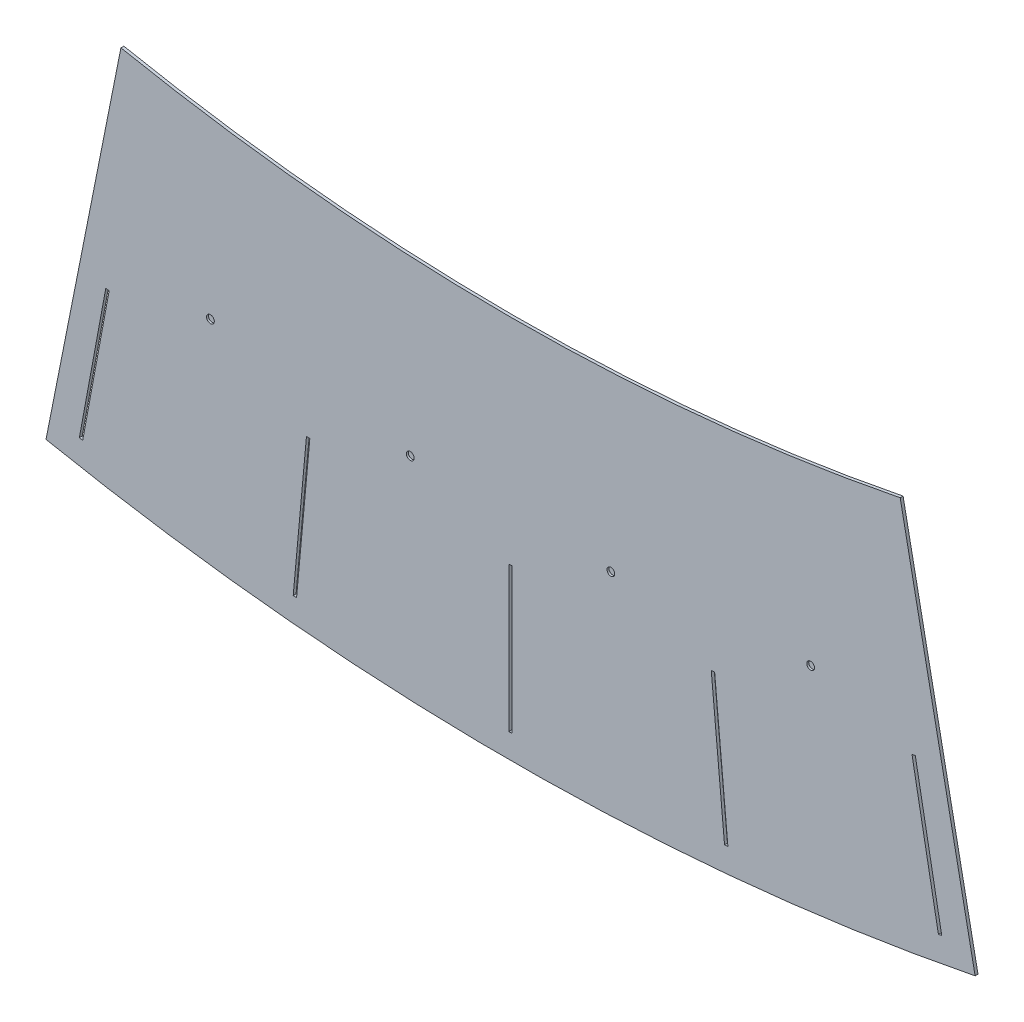
ISO-10303-21;
HEADER;
FILE_DESCRIPTION(('STEP AP214'),'2;1');
FILE_NAME('part.step','',(''),(''),'','','');
FILE_SCHEMA(('AUTOMOTIVE_DESIGN { 1 0 10303 214 1 1 1 1 }'));
ENDSEC;
DATA;
#1=APPLICATION_CONTEXT('core data for automotive mechanical design processes');
#2=APPLICATION_PROTOCOL_DEFINITION('international standard','automotive_design',2000,#1);
#3=PRODUCT_CONTEXT('',#1,'mechanical');
#4=PRODUCT('Part','Part','',(#3));
#5=PRODUCT_RELATED_PRODUCT_CATEGORY('part','',(#4));
#6=PRODUCT_DEFINITION_FORMATION('','',#4);
#7=PRODUCT_DEFINITION_CONTEXT('part definition',#1,'design');
#8=PRODUCT_DEFINITION('design','',#6,#7);
#9=PRODUCT_DEFINITION_SHAPE('','',#8);
#10=(LENGTH_UNIT() NAMED_UNIT(*) SI_UNIT(.MILLI.,.METRE.));
#11=(NAMED_UNIT(*) PLANE_ANGLE_UNIT() SI_UNIT($,.RADIAN.));
#12=(NAMED_UNIT(*) SI_UNIT($,.STERADIAN.) SOLID_ANGLE_UNIT());
#13=UNCERTAINTY_MEASURE_WITH_UNIT(LENGTH_MEASURE(1.E-05),#10,'distance_accuracy_value','');
#14=(GEOMETRIC_REPRESENTATION_CONTEXT(3) GLOBAL_UNCERTAINTY_ASSIGNED_CONTEXT((#13)) GLOBAL_UNIT_ASSIGNED_CONTEXT((#10,
#11,#12)) REPRESENTATION_CONTEXT('',''));
#15=CARTESIAN_POINT('',(0.,0.,0.));
#16=DIRECTION('',(0.,0.,1.));
#17=DIRECTION('',(1.,0.,0.));
#18=AXIS2_PLACEMENT_3D('',#15,#16,#17);
#19=CARTESIAN_POINT('',(0.,0.,3.));
#20=DIRECTION('',(0.,0.,1.));
#21=DIRECTION('',(1.,0.,0.));
#22=AXIS2_PLACEMENT_3D('',#19,#20,#21);
#23=PLANE('',#22);
#24=CARTESIAN_POINT('',(310.304616093581,-2222.,3.));
#25=DIRECTION('',(0.,0.,1.));
#26=DIRECTION('',(1.,0.,0.));
#27=AXIS2_PLACEMENT_3D('',#24,#25,#26);
#28=CIRCLE('',#27,3.99999999999999);
#29=CARTESIAN_POINT('',(314.304616093581,-2222.,3.));
#30=VERTEX_POINT('',#29);
#31=EDGE_CURVE('E700',#30,#30,#28,.T.);
#32=ORIENTED_EDGE('',*,*,#31,.F.);
#33=EDGE_LOOP('',(#32));
#34=FACE_BOUND('',#33,.T.);
#35=CARTESIAN_POINT('',(103.730524898803,-2241.16329904209,3.));
#36=DIRECTION('',(0.,0.,1.));
#37=DIRECTION('',(1.,0.,0.));
#38=AXIS2_PLACEMENT_3D('',#35,#36,#37);
#39=CIRCLE('',#38,3.99999999999996);
#40=CARTESIAN_POINT('',(107.730524898803,-2241.16329904209,3.));
#41=VERTEX_POINT('',#40);
#42=EDGE_CURVE('E708',#41,#41,#39,.T.);
#43=ORIENTED_EDGE('',*,*,#42,.F.);
#44=EDGE_LOOP('',(#43));
#45=FACE_BOUND('',#44,.T.);
#46=CARTESIAN_POINT('',(-103.730524898803,-2241.16329904209,3.));
#47=DIRECTION('',(0.,0.,1.));
#48=DIRECTION('',(1.,0.,0.));
#49=AXIS2_PLACEMENT_3D('',#46,#47,#48);
#50=CIRCLE('',#49,3.99999999999999);
#51=CARTESIAN_POINT('',(-99.7305248988026,-2241.16329904209,3.));
#52=VERTEX_POINT('',#51);
#53=EDGE_CURVE('E714',#52,#52,#50,.T.);
#54=ORIENTED_EDGE('',*,*,#53,.F.);
#55=EDGE_LOOP('',(#54));
#56=FACE_BOUND('',#55,.T.);
#57=CARTESIAN_POINT('',(-310.30461609358,-2222.,3.));
#58=DIRECTION('',(0.,0.,1.));
#59=DIRECTION('',(1.,0.,0.));
#60=AXIS2_PLACEMENT_3D('',#57,#58,#59);
#61=CIRCLE('',#60,3.99999999999988);
#62=CARTESIAN_POINT('',(-306.30461609358,-2222.,3.));
#63=VERTEX_POINT('',#62);
#64=EDGE_CURVE('E719',#63,#63,#61,.T.);
#65=ORIENTED_EDGE('',*,*,#64,.F.);
#66=EDGE_LOOP('',(#65));
#67=FACE_BOUND('',#66,.T.);
#68=CARTESIAN_POINT('',(0.,0.,3.));
#69=DIRECTION('',(0.,0.,1.));
#70=DIRECTION('',(1.,0.,0.));
#71=AXIS2_PLACEMENT_3D('',#68,#69,#70);
#72=CIRCLE('',#71,2462.);
#73=CARTESIAN_POINT('',(-480.312372803709,-2414.69336035275,3.));
#74=VERTEX_POINT('',#73);
#75=CARTESIAN_POINT('',(480.312372803709,-2414.69336035275,3.));
#76=VERTEX_POINT('',#75);
#77=EDGE_CURVE('E356',#74,#76,#72,.T.);
#78=ORIENTED_EDGE('',*,*,#77,.T.);
#79=DIRECTION('',(-0.195090322016132,0.98078528040323,0.));
#80=VECTOR('',#79,1.);
#81=CARTESIAN_POINT('',(480.312372803709,-2414.69336035275,3.));
#82=LINE('',#81,#80);
#83=CARTESIAN_POINT('',(402.861514963305,-2025.32160403267,3.));
#84=VERTEX_POINT('',#83);
#85=EDGE_CURVE('E359',#76,#84,#82,.T.);
#86=ORIENTED_EDGE('',*,*,#85,.T.);
#87=CARTESIAN_POINT('',(0.,0.,3.));
#88=DIRECTION('',(0.,0.,-1.));
#89=DIRECTION('',(1.,0.,0.));
#90=AXIS2_PLACEMENT_3D('',#87,#88,#89);
#91=CIRCLE('',#90,2065.);
#92=CARTESIAN_POINT('',(-402.861514963306,-2025.32160403267,3.));
#93=VERTEX_POINT('',#92);
#94=EDGE_CURVE('E362',#84,#93,#91,.T.);
#95=ORIENTED_EDGE('',*,*,#94,.T.);
#96=DIRECTION('',(-0.195090322016128,-0.980785280403231,0.));
#97=VECTOR('',#96,1.);
#98=CARTESIAN_POINT('',(-480.312372803709,-2414.69336035275,3.));
#99=LINE('',#98,#97);
#100=EDGE_CURVE('E364',#93,#74,#99,.T.);
#101=ORIENTED_EDGE('',*,*,#100,.T.);
#102=EDGE_LOOP('',(#78,#86,#95,#101));
#103=FACE_BOUND('',#102,.T.);
#104=DIRECTION('',(1.,0.,0.));
#105=VECTOR('',#104,1.);
#106=CARTESIAN_POINT('',(-1.75,-2437.,3.));
#107=LINE('',#106,#105);
#108=CARTESIAN_POINT('',(-1.75,-2437.,3.));
#109=VERTEX_POINT('',#108);
#110=CARTESIAN_POINT('',(1.75,-2437.,3.));
#111=VERTEX_POINT('',#110);
#112=EDGE_CURVE('E327',#109,#111,#107,.T.);
#113=ORIENTED_EDGE('',*,*,#112,.F.);
#114=DIRECTION('',(0.,-1.,0.));
#115=VECTOR('',#114,1.);
#116=CARTESIAN_POINT('',(-1.75,-2287.,3.));
#117=LINE('',#116,#115);
#118=CARTESIAN_POINT('',(-1.75,-2287.,3.));
#119=VERTEX_POINT('',#118);
#120=EDGE_CURVE('E325',#119,#109,#117,.T.);
#121=ORIENTED_EDGE('',*,*,#120,.F.);
#122=DIRECTION('',(-1.,0.,0.));
#123=VECTOR('',#122,1.);
#124=CARTESIAN_POINT('',(-1.75,-2287.,3.));
#125=LINE('',#124,#123);
#126=CARTESIAN_POINT('',(1.75,-2287.,3.));
#127=VERTEX_POINT('',#126);
#128=EDGE_CURVE('E333',#127,#119,#125,.T.);
#129=ORIENTED_EDGE('',*,*,#128,.F.);
#130=DIRECTION('',(0.,1.,0.));
#131=VECTOR('',#130,1.);
#132=CARTESIAN_POINT('',(1.75,-2287.,3.));
#133=LINE('',#132,#131);
#134=EDGE_CURVE('E330',#111,#127,#133,.T.);
#135=ORIENTED_EDGE('',*,*,#134,.F.);
#136=EDGE_LOOP('',(#113,#121,#129,#135));
#137=FACE_BOUND('',#136,.T.);
#138=DIRECTION('',(-0.0915016186634029,-0.995804927574662,0.));
#139=VECTOR('',#138,1.);
#140=CARTESIAN_POINT('',(-211.006860506458,-2277.24574153059,3.));
#141=LINE('',#140,#139);
#142=CARTESIAN_POINT('',(-211.006860506458,-2277.24574153059,3.));
#143=VERTEX_POINT('',#142);
#144=CARTESIAN_POINT('',(-224.732103305969,-2426.61648066679,3.));
#145=VERTEX_POINT('',#144);
#146=EDGE_CURVE('E296',#143,#145,#141,.T.);
#147=ORIENTED_EDGE('',*,*,#146,.F.);
#148=DIRECTION('',(-0.995804927574656,0.0915016186634634,0.));
#149=VECTOR('',#148,1.);
#150=CARTESIAN_POINT('',(-211.006860506458,-2277.24574153059,3.));
#151=LINE('',#150,#149);
#152=CARTESIAN_POINT('',(-207.521543259947,-2277.56599719591,3.));
#153=VERTEX_POINT('',#152);
#154=EDGE_CURVE('E294',#153,#143,#151,.T.);
#155=ORIENTED_EDGE('',*,*,#154,.F.);
#156=DIRECTION('',(0.0915016186634029,0.995804927574662,0.));
#157=VECTOR('',#156,1.);
#158=CARTESIAN_POINT('',(-207.521543259947,-2277.56599719591,3.));
#159=LINE('',#158,#157);
#160=CARTESIAN_POINT('',(-221.246786059457,-2426.93673633211,3.));
#161=VERTEX_POINT('',#160);
#162=EDGE_CURVE('E302',#161,#153,#159,.T.);
#163=ORIENTED_EDGE('',*,*,#162,.F.);
#164=DIRECTION('',(0.995804927574656,-0.0915016186634634,0.));
#165=VECTOR('',#164,1.);
#166=CARTESIAN_POINT('',(-224.732103305969,-2426.61648066679,3.));
#167=LINE('',#166,#165);
#168=EDGE_CURVE('E299',#145,#161,#167,.T.);
#169=ORIENTED_EDGE('',*,*,#168,.F.);
#170=EDGE_LOOP('',(#147,#155,#163,#169));
#171=FACE_BOUND('',#170,.T.);
#172=DIRECTION('',(-0.182235525492149,-0.983254907563955,0.));
#173=VECTOR('',#172,1.);
#174=CARTESIAN_POINT('',(-418.49334288878,-2248.38506142915,3.));
#175=LINE('',#174,#173);
#176=CARTESIAN_POINT('',(-418.49334288878,-2248.38506142915,3.));
#177=VERTEX_POINT('',#176);
#178=CARTESIAN_POINT('',(-445.828671712603,-2395.87329756375,3.));
#179=VERTEX_POINT('',#178);
#180=EDGE_CURVE('E265',#177,#179,#175,.T.);
#181=ORIENTED_EDGE('',*,*,#180,.F.);
#182=DIRECTION('',(-0.983254907563959,0.182235525492127,0.));
#183=VECTOR('',#182,1.);
#184=CARTESIAN_POINT('',(-418.49334288878,-2248.38506142915,3.));
#185=LINE('',#184,#183);
#186=CARTESIAN_POINT('',(-415.051950712307,-2249.02288576838,3.));
#187=VERTEX_POINT('',#186);
#188=EDGE_CURVE('E263',#187,#177,#185,.T.);
#189=ORIENTED_EDGE('',*,*,#188,.F.);
#190=DIRECTION('',(0.182235525492149,0.983254907563955,0.));
#191=VECTOR('',#190,1.);
#192=CARTESIAN_POINT('',(-415.051950712307,-2249.02288576838,3.));
#193=LINE('',#192,#191);
#194=CARTESIAN_POINT('',(-442.387279536129,-2396.51112190297,3.));
#195=VERTEX_POINT('',#194);
#196=EDGE_CURVE('E271',#195,#187,#193,.T.);
#197=ORIENTED_EDGE('',*,*,#196,.F.);
#198=DIRECTION('',(0.983254907563959,-0.182235525492127,0.));
#199=VECTOR('',#198,1.);
#200=CARTESIAN_POINT('',(-445.828671712603,-2395.87329756375,3.));
#201=LINE('',#200,#199);
#202=EDGE_CURVE('E268',#179,#195,#201,.T.);
#203=ORIENTED_EDGE('',*,*,#202,.F.);
#204=EDGE_LOOP('',(#181,#189,#197,#203));
#205=FACE_BOUND('',#204,.T.);
#206=DIRECTION('',(0.0915016186634031,-0.995804927574662,0.));
#207=VECTOR('',#206,1.);
#208=CARTESIAN_POINT('',(207.521543259947,-2277.56599719591,3.));
#209=LINE('',#208,#207);
#210=CARTESIAN_POINT('',(207.521543259947,-2277.56599719591,3.));
#211=VERTEX_POINT('',#210);
#212=CARTESIAN_POINT('',(221.246786059457,-2426.93673633211,3.));
#213=VERTEX_POINT('',#212);
#214=EDGE_CURVE('E234',#211,#213,#209,.T.);
#215=ORIENTED_EDGE('',*,*,#214,.F.);
#216=DIRECTION('',(-0.995804927574656,-0.0915016186634627,0.));
#217=VECTOR('',#216,1.);
#218=CARTESIAN_POINT('',(207.521543259947,-2277.56599719591,3.));
#219=LINE('',#218,#217);
#220=CARTESIAN_POINT('',(211.006860506458,-2277.24574153059,3.));
#221=VERTEX_POINT('',#220);
#222=EDGE_CURVE('E232',#221,#211,#219,.T.);
#223=ORIENTED_EDGE('',*,*,#222,.F.);
#224=DIRECTION('',(-0.0915016186634029,0.995804927574662,0.));
#225=VECTOR('',#224,1.);
#226=CARTESIAN_POINT('',(211.006860506458,-2277.24574153059,3.));
#227=LINE('',#226,#225);
#228=CARTESIAN_POINT('',(224.732103305968,-2426.61648066679,3.));
#229=VERTEX_POINT('',#228);
#230=EDGE_CURVE('E240',#229,#221,#227,.T.);
#231=ORIENTED_EDGE('',*,*,#230,.F.);
#232=DIRECTION('',(0.995804927574656,0.0915016186634634,0.));
#233=VECTOR('',#232,1.);
#234=CARTESIAN_POINT('',(221.246786059457,-2426.93673633211,3.));
#235=LINE('',#234,#233);
#236=EDGE_CURVE('E237',#213,#229,#235,.T.);
#237=ORIENTED_EDGE('',*,*,#236,.F.);
#238=EDGE_LOOP('',(#215,#223,#231,#237));
#239=FACE_BOUND('',#238,.T.);
#240=DIRECTION('',(0.182235525492149,-0.983254907563955,0.));
#241=VECTOR('',#240,1.);
#242=CARTESIAN_POINT('',(415.051950712307,-2249.02288576837,3.));
#243=LINE('',#242,#241);
#244=CARTESIAN_POINT('',(415.051950712307,-2249.02288576837,3.));
#245=VERTEX_POINT('',#244);
#246=CARTESIAN_POINT('',(442.387279536129,-2396.51112190297,3.));
#247=VERTEX_POINT('',#246);
#248=EDGE_CURVE('E202',#245,#247,#243,.T.);
#249=ORIENTED_EDGE('',*,*,#248,.F.);
#250=DIRECTION('',(-0.983254907563958,-0.182235525492129,0.));
#251=VECTOR('',#250,1.);
#252=CARTESIAN_POINT('',(415.051950712307,-2249.02288576837,3.));
#253=LINE('',#252,#251);
#254=CARTESIAN_POINT('',(418.49334288878,-2248.38506142915,3.));
#255=VERTEX_POINT('',#254);
#256=EDGE_CURVE('E194',#255,#245,#253,.T.);
#257=ORIENTED_EDGE('',*,*,#256,.F.);
#258=DIRECTION('',(-0.182235525492149,0.983254907563955,0.));
#259=VECTOR('',#258,1.);
#260=CARTESIAN_POINT('',(418.49334288878,-2248.38506142915,3.));
#261=LINE('',#260,#259);
#262=CARTESIAN_POINT('',(445.828671712603,-2395.87329756375,3.));
#263=VERTEX_POINT('',#262);
#264=EDGE_CURVE('E216',#263,#255,#261,.T.);
#265=ORIENTED_EDGE('',*,*,#264,.F.);
#266=DIRECTION('',(0.983254907563959,0.182235525492127,0.));
#267=VECTOR('',#266,1.);
#268=CARTESIAN_POINT('',(442.387279536129,-2396.51112190297,3.));
#269=LINE('',#268,#267);
#270=EDGE_CURVE('E214',#247,#263,#269,.T.);
#271=ORIENTED_EDGE('',*,*,#270,.F.);
#272=EDGE_LOOP('',(#249,#257,#265,#271));
#273=FACE_BOUND('',#272,.T.);
#274=ADVANCED_FACE('F33',(#34,#45,#56,#67,#103,#137,#171,#205,#239,#273),#23,.T.);
#275=CARTESIAN_POINT('',(0.,0.,0.));
#276=DIRECTION('',(0.,0.,1.));
#277=DIRECTION('',(1.,0.,0.));
#278=AXIS2_PLACEMENT_3D('',#275,#276,#277);
#279=PLANE('',#278);
#280=DIRECTION('',(-0.995804927574656,-0.0915016186634627,0.));
#281=VECTOR('',#280,1.);
#282=CARTESIAN_POINT('',(207.521543259947,-2277.56599719591,0.));
#283=LINE('',#282,#281);
#284=CARTESIAN_POINT('',(211.006860506458,-2277.24574153059,0.));
#285=VERTEX_POINT('',#284);
#286=CARTESIAN_POINT('',(207.521543259947,-2277.56599719591,0.));
#287=VERTEX_POINT('',#286);
#288=EDGE_CURVE('E210',#285,#287,#283,.T.);
#289=ORIENTED_EDGE('',*,*,#288,.T.);
#290=DIRECTION('',(0.0915016186634031,-0.995804927574662,0.));
#291=VECTOR('',#290,1.);
#292=CARTESIAN_POINT('',(207.521543259947,-2277.56599719591,0.));
#293=LINE('',#292,#291);
#294=CARTESIAN_POINT('',(221.246786059457,-2426.93673633211,0.));
#295=VERTEX_POINT('',#294);
#296=EDGE_CURVE('E245',#287,#295,#293,.T.);
#297=ORIENTED_EDGE('',*,*,#296,.T.);
#298=DIRECTION('',(0.995804927574656,0.0915016186634634,0.));
#299=VECTOR('',#298,1.);
#300=CARTESIAN_POINT('',(221.246786059457,-2426.93673633211,0.));
#301=LINE('',#300,#299);
#302=CARTESIAN_POINT('',(224.732103305969,-2426.61648066679,0.));
#303=VERTEX_POINT('',#302);
#304=EDGE_CURVE('E248',#295,#303,#301,.T.);
#305=ORIENTED_EDGE('',*,*,#304,.T.);
#306=DIRECTION('',(-0.0915016186634029,0.995804927574662,0.));
#307=VECTOR('',#306,1.);
#308=CARTESIAN_POINT('',(211.006860506458,-2277.24574153059,0.));
#309=LINE('',#308,#307);
#310=EDGE_CURVE('E235',#303,#285,#309,.T.);
#311=ORIENTED_EDGE('',*,*,#310,.T.);
#312=EDGE_LOOP('',(#289,#297,#305,#311));
#313=FACE_BOUND('',#312,.T.);
#314=DIRECTION('',(-0.995804927574656,0.0915016186634634,0.));
#315=VECTOR('',#314,1.);
#316=CARTESIAN_POINT('',(-211.006860506458,-2277.24574153059,0.));
#317=LINE('',#316,#315);
#318=CARTESIAN_POINT('',(-207.521543259947,-2277.56599719591,0.));
#319=VERTEX_POINT('',#318);
#320=CARTESIAN_POINT('',(-211.006860506458,-2277.24574153059,0.));
#321=VERTEX_POINT('',#320);
#322=EDGE_CURVE('E293',#319,#321,#317,.T.);
#323=ORIENTED_EDGE('',*,*,#322,.T.);
#324=DIRECTION('',(-0.0915016186634029,-0.995804927574662,0.));
#325=VECTOR('',#324,1.);
#326=CARTESIAN_POINT('',(-211.006860506458,-2277.24574153059,0.));
#327=LINE('',#326,#325);
#328=CARTESIAN_POINT('',(-224.732103305969,-2426.61648066679,0.));
#329=VERTEX_POINT('',#328);
#330=EDGE_CURVE('E307',#321,#329,#327,.T.);
#331=ORIENTED_EDGE('',*,*,#330,.T.);
#332=DIRECTION('',(0.995804927574656,-0.0915016186634634,0.));
#333=VECTOR('',#332,1.);
#334=CARTESIAN_POINT('',(-224.732103305969,-2426.61648066679,0.));
#335=LINE('',#334,#333);
#336=CARTESIAN_POINT('',(-221.246786059457,-2426.93673633211,0.));
#337=VERTEX_POINT('',#336);
#338=EDGE_CURVE('E310',#329,#337,#335,.T.);
#339=ORIENTED_EDGE('',*,*,#338,.T.);
#340=DIRECTION('',(0.0915016186634029,0.995804927574662,0.));
#341=VECTOR('',#340,1.);
#342=CARTESIAN_POINT('',(-207.521543259947,-2277.56599719591,0.));
#343=LINE('',#342,#341);
#344=EDGE_CURVE('E297',#337,#319,#343,.T.);
#345=ORIENTED_EDGE('',*,*,#344,.T.);
#346=EDGE_LOOP('',(#323,#331,#339,#345));
#347=FACE_BOUND('',#346,.T.);
#348=CARTESIAN_POINT('',(0.,0.,0.));
#349=DIRECTION('',(0.,0.,1.));
#350=DIRECTION('',(1.,0.,0.));
#351=AXIS2_PLACEMENT_3D('',#348,#349,#350);
#352=CIRCLE('',#351,2462.);
#353=CARTESIAN_POINT('',(-480.312372803709,-2414.69336035275,0.));
#354=VERTEX_POINT('',#353);
#355=CARTESIAN_POINT('',(480.312372803709,-2414.69336035275,0.));
#356=VERTEX_POINT('',#355);
#357=EDGE_CURVE('E355',#354,#356,#352,.T.);
#358=ORIENTED_EDGE('',*,*,#357,.F.);
#359=DIRECTION('',(-0.195090322016128,-0.980785280403231,0.));
#360=VECTOR('',#359,1.);
#361=CARTESIAN_POINT('',(-480.312372803709,-2414.69336035275,0.));
#362=LINE('',#361,#360);
#363=CARTESIAN_POINT('',(-402.861514963306,-2025.32160403267,0.));
#364=VERTEX_POINT('',#363);
#365=EDGE_CURVE('E360',#364,#354,#362,.T.);
#366=ORIENTED_EDGE('',*,*,#365,.F.);
#367=CARTESIAN_POINT('',(0.,0.,0.));
#368=DIRECTION('',(0.,0.,-1.));
#369=DIRECTION('',(1.,0.,0.));
#370=AXIS2_PLACEMENT_3D('',#367,#368,#369);
#371=CIRCLE('',#370,2065.);
#372=CARTESIAN_POINT('',(402.861514963305,-2025.32160403267,0.));
#373=VERTEX_POINT('',#372);
#374=EDGE_CURVE('E371',#373,#364,#371,.T.);
#375=ORIENTED_EDGE('',*,*,#374,.F.);
#376=DIRECTION('',(-0.195090322016132,0.98078528040323,0.));
#377=VECTOR('',#376,1.);
#378=CARTESIAN_POINT('',(480.312372803709,-2414.69336035275,0.));
#379=LINE('',#378,#377);
#380=EDGE_CURVE('E369',#356,#373,#379,.T.);
#381=ORIENTED_EDGE('',*,*,#380,.F.);
#382=EDGE_LOOP('',(#358,#366,#375,#381));
#383=FACE_BOUND('',#382,.T.);
#384=DIRECTION('',(0.,-1.,0.));
#385=VECTOR('',#384,1.);
#386=CARTESIAN_POINT('',(-1.75,-2287.,0.));
#387=LINE('',#386,#385);
#388=CARTESIAN_POINT('',(-1.75,-2287.,0.));
#389=VERTEX_POINT('',#388);
#390=CARTESIAN_POINT('',(-1.75,-2437.,0.));
#391=VERTEX_POINT('',#390);
#392=EDGE_CURVE('E324',#389,#391,#387,.T.);
#393=ORIENTED_EDGE('',*,*,#392,.T.);
#394=DIRECTION('',(1.,0.,0.));
#395=VECTOR('',#394,1.);
#396=CARTESIAN_POINT('',(-1.75,-2437.,0.));
#397=LINE('',#396,#395);
#398=CARTESIAN_POINT('',(1.75,-2437.,0.));
#399=VERTEX_POINT('',#398);
#400=EDGE_CURVE('E338',#391,#399,#397,.T.);
#401=ORIENTED_EDGE('',*,*,#400,.T.);
#402=DIRECTION('',(0.,1.,0.));
#403=VECTOR('',#402,1.);
#404=CARTESIAN_POINT('',(1.75,-2287.,0.));
#405=LINE('',#404,#403);
#406=CARTESIAN_POINT('',(1.75,-2287.,0.));
#407=VERTEX_POINT('',#406);
#408=EDGE_CURVE('E341',#399,#407,#405,.T.);
#409=ORIENTED_EDGE('',*,*,#408,.T.);
#410=DIRECTION('',(-1.,0.,0.));
#411=VECTOR('',#410,1.);
#412=CARTESIAN_POINT('',(-1.75,-2287.,0.));
#413=LINE('',#412,#411);
#414=EDGE_CURVE('E328',#407,#389,#413,.T.);
#415=ORIENTED_EDGE('',*,*,#414,.T.);
#416=EDGE_LOOP('',(#393,#401,#409,#415));
#417=FACE_BOUND('',#416,.T.);
#418=DIRECTION('',(-0.983254907563959,0.182235525492127,0.));
#419=VECTOR('',#418,1.);
#420=CARTESIAN_POINT('',(-418.49334288878,-2248.38506142915,0.));
#421=LINE('',#420,#419);
#422=CARTESIAN_POINT('',(-415.051950712307,-2249.02288576837,0.));
#423=VERTEX_POINT('',#422);
#424=CARTESIAN_POINT('',(-418.49334288878,-2248.38506142915,0.));
#425=VERTEX_POINT('',#424);
#426=EDGE_CURVE('E262',#423,#425,#421,.T.);
#427=ORIENTED_EDGE('',*,*,#426,.T.);
#428=DIRECTION('',(-0.182235525492149,-0.983254907563955,0.));
#429=VECTOR('',#428,1.);
#430=CARTESIAN_POINT('',(-418.49334288878,-2248.38506142915,0.));
#431=LINE('',#430,#429);
#432=CARTESIAN_POINT('',(-445.828671712603,-2395.87329756375,0.));
#433=VERTEX_POINT('',#432);
#434=EDGE_CURVE('E276',#425,#433,#431,.T.);
#435=ORIENTED_EDGE('',*,*,#434,.T.);
#436=DIRECTION('',(0.983254907563959,-0.182235525492127,0.));
#437=VECTOR('',#436,1.);
#438=CARTESIAN_POINT('',(-445.828671712603,-2395.87329756375,0.));
#439=LINE('',#438,#437);
#440=CARTESIAN_POINT('',(-442.387279536129,-2396.51112190297,0.));
#441=VERTEX_POINT('',#440);
#442=EDGE_CURVE('E279',#433,#441,#439,.T.);
#443=ORIENTED_EDGE('',*,*,#442,.T.);
#444=DIRECTION('',(0.182235525492149,0.983254907563955,0.));
#445=VECTOR('',#444,1.);
#446=CARTESIAN_POINT('',(-415.051950712307,-2249.02288576838,0.));
#447=LINE('',#446,#445);
#448=EDGE_CURVE('E266',#441,#423,#447,.T.);
#449=ORIENTED_EDGE('',*,*,#448,.T.);
#450=EDGE_LOOP('',(#427,#435,#443,#449));
#451=FACE_BOUND('',#450,.T.);
#452=DIRECTION('',(-0.983254907563958,-0.182235525492129,0.));
#453=VECTOR('',#452,1.);
#454=CARTESIAN_POINT('',(415.051950712307,-2249.02288576837,0.));
#455=LINE('',#454,#453);
#456=CARTESIAN_POINT('',(418.49334288878,-2248.38506142915,0.));
#457=VERTEX_POINT('',#456);
#458=CARTESIAN_POINT('',(415.051950712307,-2249.02288576837,0.));
#459=VERTEX_POINT('',#458);
#460=EDGE_CURVE('E56',#457,#459,#455,.T.);
#461=ORIENTED_EDGE('',*,*,#460,.T.);
#462=DIRECTION('',(0.182235525492149,-0.983254907563955,0.));
#463=VECTOR('',#462,1.);
#464=CARTESIAN_POINT('',(415.051950712307,-2249.02288576837,0.));
#465=LINE('',#464,#463);
#466=CARTESIAN_POINT('',(442.387279536129,-2396.51112190297,0.));
#467=VERTEX_POINT('',#466);
#468=EDGE_CURVE('E209',#459,#467,#465,.T.);
#469=ORIENTED_EDGE('',*,*,#468,.T.);
#470=DIRECTION('',(0.983254907563959,0.182235525492127,0.));
#471=VECTOR('',#470,1.);
#472=CARTESIAN_POINT('',(442.387279536129,-2396.51112190297,0.));
#473=LINE('',#472,#471);
#474=CARTESIAN_POINT('',(445.828671712603,-2395.87329756374,0.));
#475=VERTEX_POINT('',#474);
#476=EDGE_CURVE('E224',#467,#475,#473,.T.);
#477=ORIENTED_EDGE('',*,*,#476,.T.);
#478=DIRECTION('',(-0.182235525492149,0.983254907563955,0.));
#479=VECTOR('',#478,1.);
#480=CARTESIAN_POINT('',(418.49334288878,-2248.38506142915,0.));
#481=LINE('',#480,#479);
#482=EDGE_CURVE('E203',#475,#457,#481,.T.);
#483=ORIENTED_EDGE('',*,*,#482,.T.);
#484=EDGE_LOOP('',(#461,#469,#477,#483));
#485=FACE_BOUND('',#484,.T.);
#486=ADVANCED_FACE('F389',(#313,#347,#383,#417,#451,#485),#279,.F.);
#487=CARTESIAN_POINT('',(0.,0.,3.));
#488=DIRECTION('',(0.,0.,-1.));
#489=DIRECTION('',(-1.,0.,0.));
#490=AXIS2_PLACEMENT_3D('',#487,#488,#489);
#491=CYLINDRICAL_SURFACE('',#490,2462.);
#492=ORIENTED_EDGE('',*,*,#357,.T.);
#493=DIRECTION('',(0.,0.,-1.));
#494=VECTOR('',#493,1.);
#495=CARTESIAN_POINT('',(480.312372803709,-2414.69336035275,3.));
#496=LINE('',#495,#494);
#497=EDGE_CURVE('E11',#76,#356,#496,.T.);
#498=ORIENTED_EDGE('',*,*,#497,.F.);
#499=ORIENTED_EDGE('',*,*,#77,.F.);
#500=DIRECTION('',(0.,0.,-1.));
#501=VECTOR('',#500,1.);
#502=CARTESIAN_POINT('',(-480.312372803709,-2414.69336035275,3.));
#503=LINE('',#502,#501);
#504=EDGE_CURVE('E366',#74,#354,#503,.T.);
#505=ORIENTED_EDGE('',*,*,#504,.T.);
#506=EDGE_LOOP('',(#492,#498,#499,#505));
#507=FACE_BOUND('',#506,.T.);
#508=ADVANCED_FACE('F35',(#507),#491,.T.);
#509=CARTESIAN_POINT('',(480.312372803709,-2414.69336035275,3.));
#510=DIRECTION('',(-0.98078528040323,-0.195090322016132,0.));
#511=DIRECTION('',(0.195090322016132,-0.98078528040323,0.));
#512=AXIS2_PLACEMENT_3D('',#509,#510,#511);
#513=PLANE('',#512);
#514=ORIENTED_EDGE('',*,*,#380,.T.);
#515=DIRECTION('',(0.,0.,-1.));
#516=VECTOR('',#515,1.);
#517=CARTESIAN_POINT('',(402.861514963305,-2025.32160403267,3.));
#518=LINE('',#517,#516);
#519=EDGE_CURVE('E41',#84,#373,#518,.T.);
#520=ORIENTED_EDGE('',*,*,#519,.F.);
#521=ORIENTED_EDGE('',*,*,#85,.F.);
#522=ORIENTED_EDGE('',*,*,#497,.T.);
#523=EDGE_LOOP('',(#514,#520,#521,#522));
#524=FACE_BOUND('',#523,.T.);
#525=ADVANCED_FACE('F400',(#524),#513,.F.);
#526=CARTESIAN_POINT('',(0.,0.,3.));
#527=DIRECTION('',(0.,0.,-1.));
#528=DIRECTION('',(-1.,0.,0.));
#529=AXIS2_PLACEMENT_3D('',#526,#527,#528);
#530=CYLINDRICAL_SURFACE('',#529,2065.);
#531=ORIENTED_EDGE('',*,*,#374,.T.);
#532=DIRECTION('',(0.,0.,-1.));
#533=VECTOR('',#532,1.);
#534=CARTESIAN_POINT('',(-402.861514963306,-2025.32160403267,3.));
#535=LINE('',#534,#533);
#536=EDGE_CURVE('E376',#93,#364,#535,.T.);
#537=ORIENTED_EDGE('',*,*,#536,.F.);
#538=ORIENTED_EDGE('',*,*,#94,.F.);
#539=ORIENTED_EDGE('',*,*,#519,.T.);
#540=EDGE_LOOP('',(#531,#537,#538,#539));
#541=FACE_BOUND('',#540,.T.);
#542=ADVANCED_FACE('F383',(#541),#530,.F.);
#543=CARTESIAN_POINT('',(-480.312372803709,-2414.69336035275,3.));
#544=DIRECTION('',(0.98078528040323,-0.195090322016128,0.));
#545=DIRECTION('',(0.195090322016128,0.980785280403231,0.));
#546=AXIS2_PLACEMENT_3D('',#543,#544,#545);
#547=PLANE('',#546);
#548=ORIENTED_EDGE('',*,*,#365,.T.);
#549=ORIENTED_EDGE('',*,*,#504,.F.);
#550=ORIENTED_EDGE('',*,*,#100,.F.);
#551=ORIENTED_EDGE('',*,*,#536,.T.);
#552=EDGE_LOOP('',(#548,#549,#550,#551));
#553=FACE_BOUND('',#552,.T.);
#554=ADVANCED_FACE('F393',(#553),#547,.F.);
#555=CARTESIAN_POINT('',(-1.75,-2287.,3.));
#556=DIRECTION('',(1.,0.,0.));
#557=DIRECTION('',(0.,0.,-1.));
#558=AXIS2_PLACEMENT_3D('',#555,#556,#557);
#559=PLANE('',#558);
#560=ORIENTED_EDGE('',*,*,#392,.F.);
#561=DIRECTION('',(0.,0.,-1.));
#562=VECTOR('',#561,1.);
#563=CARTESIAN_POINT('',(-1.75,-2287.,3.));
#564=LINE('',#563,#562);
#565=EDGE_CURVE('E335',#119,#389,#564,.T.);
#566=ORIENTED_EDGE('',*,*,#565,.F.);
#567=ORIENTED_EDGE('',*,*,#120,.T.);
#568=DIRECTION('',(0.,0.,-1.));
#569=VECTOR('',#568,1.);
#570=CARTESIAN_POINT('',(-1.75,-2437.,3.));
#571=LINE('',#570,#569);
#572=EDGE_CURVE('E352',#109,#391,#571,.T.);
#573=ORIENTED_EDGE('',*,*,#572,.T.);
#574=EDGE_LOOP('',(#560,#566,#567,#573));
#575=FACE_BOUND('',#574,.T.);
#576=ADVANCED_FACE('F418',(#575),#559,.T.);
#577=CARTESIAN_POINT('',(-1.75,-2437.,3.));
#578=DIRECTION('',(0.,1.,0.));
#579=DIRECTION('',(0.,0.,1.));
#580=AXIS2_PLACEMENT_3D('',#577,#578,#579);
#581=PLANE('',#580);
#582=ORIENTED_EDGE('',*,*,#400,.F.);
#583=ORIENTED_EDGE('',*,*,#572,.F.);
#584=ORIENTED_EDGE('',*,*,#112,.T.);
#585=DIRECTION('',(0.,0.,-1.));
#586=VECTOR('',#585,1.);
#587=CARTESIAN_POINT('',(1.75,-2437.,3.));
#588=LINE('',#587,#586);
#589=EDGE_CURVE('E350',#111,#399,#588,.T.);
#590=ORIENTED_EDGE('',*,*,#589,.T.);
#591=EDGE_LOOP('',(#582,#583,#584,#590));
#592=FACE_BOUND('',#591,.T.);
#593=ADVANCED_FACE('F425',(#592),#581,.T.);
#594=CARTESIAN_POINT('',(1.75,-2287.,3.));
#595=DIRECTION('',(-1.,0.,0.));
#596=DIRECTION('',(0.,0.,1.));
#597=AXIS2_PLACEMENT_3D('',#594,#595,#596);
#598=PLANE('',#597);
#599=ORIENTED_EDGE('',*,*,#408,.F.);
#600=ORIENTED_EDGE('',*,*,#589,.F.);
#601=ORIENTED_EDGE('',*,*,#134,.T.);
#602=DIRECTION('',(0.,0.,-1.));
#603=VECTOR('',#602,1.);
#604=CARTESIAN_POINT('',(1.75,-2287.,3.));
#605=LINE('',#604,#603);
#606=EDGE_CURVE('E348',#127,#407,#605,.T.);
#607=ORIENTED_EDGE('',*,*,#606,.T.);
#608=EDGE_LOOP('',(#599,#600,#601,#607));
#609=FACE_BOUND('',#608,.T.);
#610=ADVANCED_FACE('F430',(#609),#598,.T.);
#611=CARTESIAN_POINT('',(-1.75,-2287.,3.));
#612=DIRECTION('',(0.,-1.,0.));
#613=DIRECTION('',(0.,0.,-1.));
#614=AXIS2_PLACEMENT_3D('',#611,#612,#613);
#615=PLANE('',#614);
#616=ORIENTED_EDGE('',*,*,#414,.F.);
#617=ORIENTED_EDGE('',*,*,#606,.F.);
#618=ORIENTED_EDGE('',*,*,#128,.T.);
#619=ORIENTED_EDGE('',*,*,#565,.T.);
#620=EDGE_LOOP('',(#616,#617,#618,#619));
#621=FACE_BOUND('',#620,.T.);
#622=ADVANCED_FACE('F437',(#621),#615,.T.);
#623=CARTESIAN_POINT('',(-211.006860506458,-2277.24574153059,3.));
#624=DIRECTION('',(-0.0915016186634634,-0.995804927574656,0.));
#625=DIRECTION('',(0.995804927574656,-0.0915016186634634,0.));
#626=AXIS2_PLACEMENT_3D('',#623,#624,#625);
#627=PLANE('',#626);
#628=ORIENTED_EDGE('',*,*,#322,.F.);
#629=DIRECTION('',(0.,0.,-1.));
#630=VECTOR('',#629,1.);
#631=CARTESIAN_POINT('',(-207.521543259947,-2277.56599719591,3.));
#632=LINE('',#631,#630);
#633=EDGE_CURVE('E304',#153,#319,#632,.T.);
#634=ORIENTED_EDGE('',*,*,#633,.F.);
#635=ORIENTED_EDGE('',*,*,#154,.T.);
#636=DIRECTION('',(0.,0.,-1.));
#637=VECTOR('',#636,1.);
#638=CARTESIAN_POINT('',(-211.006860506458,-2277.24574153059,3.));
#639=LINE('',#638,#637);
#640=EDGE_CURVE('E321',#143,#321,#639,.T.);
#641=ORIENTED_EDGE('',*,*,#640,.T.);
#642=EDGE_LOOP('',(#628,#634,#635,#641));
#643=FACE_BOUND('',#642,.T.);
#644=ADVANCED_FACE('F513',(#643),#627,.T.);
#645=CARTESIAN_POINT('',(-211.006860506458,-2277.24574153059,3.));
#646=DIRECTION('',(0.995804927574662,-0.0915016186634029,0.));
#647=DIRECTION('',(0.0915016186634029,0.995804927574662,0.));
#648=AXIS2_PLACEMENT_3D('',#645,#646,#647);
#649=PLANE('',#648);
#650=ORIENTED_EDGE('',*,*,#330,.F.);
#651=ORIENTED_EDGE('',*,*,#640,.F.);
#652=ORIENTED_EDGE('',*,*,#146,.T.);
#653=DIRECTION('',(0.,0.,-1.));
#654=VECTOR('',#653,1.);
#655=CARTESIAN_POINT('',(-224.732103305969,-2426.61648066679,3.));
#656=LINE('',#655,#654);
#657=EDGE_CURVE('E319',#145,#329,#656,.T.);
#658=ORIENTED_EDGE('',*,*,#657,.T.);
#659=EDGE_LOOP('',(#650,#651,#652,#658));
#660=FACE_BOUND('',#659,.T.);
#661=ADVANCED_FACE('F509',(#660),#649,.T.);
#662=CARTESIAN_POINT('',(-224.732103305969,-2426.61648066679,3.));
#663=DIRECTION('',(0.0915016186634634,0.995804927574656,0.));
#664=DIRECTION('',(-0.995804927574656,0.0915016186634634,0.));
#665=AXIS2_PLACEMENT_3D('',#662,#663,#664);
#666=PLANE('',#665);
#667=ORIENTED_EDGE('',*,*,#338,.F.);
#668=ORIENTED_EDGE('',*,*,#657,.F.);
#669=ORIENTED_EDGE('',*,*,#168,.T.);
#670=DIRECTION('',(0.,0.,-1.));
#671=VECTOR('',#670,1.);
#672=CARTESIAN_POINT('',(-221.246786059457,-2426.93673633211,3.));
#673=LINE('',#672,#671);
#674=EDGE_CURVE('E317',#161,#337,#673,.T.);
#675=ORIENTED_EDGE('',*,*,#674,.T.);
#676=EDGE_LOOP('',(#667,#668,#669,#675));
#677=FACE_BOUND('',#676,.T.);
#678=ADVANCED_FACE('F505',(#677),#666,.T.);
#679=CARTESIAN_POINT('',(-207.521543259947,-2277.56599719591,3.));
#680=DIRECTION('',(-0.995804927574662,0.0915016186634029,0.));
#681=DIRECTION('',(-0.0915016186634029,-0.995804927574662,0.));
#682=AXIS2_PLACEMENT_3D('',#679,#680,#681);
#683=PLANE('',#682);
#684=ORIENTED_EDGE('',*,*,#344,.F.);
#685=ORIENTED_EDGE('',*,*,#674,.F.);
#686=ORIENTED_EDGE('',*,*,#162,.T.);
#687=ORIENTED_EDGE('',*,*,#633,.T.);
#688=EDGE_LOOP('',(#684,#685,#686,#687));
#689=FACE_BOUND('',#688,.T.);
#690=ADVANCED_FACE('F501',(#689),#683,.T.);
#691=CARTESIAN_POINT('',(-418.49334288878,-2248.38506142915,3.));
#692=DIRECTION('',(-0.182235525492126,-0.983254907563958,0.));
#693=DIRECTION('',(0.983254907563959,-0.182235525492126,0.));
#694=AXIS2_PLACEMENT_3D('',#691,#692,#693);
#695=PLANE('',#694);
#696=ORIENTED_EDGE('',*,*,#426,.F.);
#697=DIRECTION('',(0.,0.,-1.));
#698=VECTOR('',#697,1.);
#699=CARTESIAN_POINT('',(-415.051950712307,-2249.02288576838,3.));
#700=LINE('',#699,#698);
#701=EDGE_CURVE('E273',#187,#423,#700,.T.);
#702=ORIENTED_EDGE('',*,*,#701,.F.);
#703=ORIENTED_EDGE('',*,*,#188,.T.);
#704=DIRECTION('',(0.,0.,-1.));
#705=VECTOR('',#704,1.);
#706=CARTESIAN_POINT('',(-418.49334288878,-2248.38506142915,3.));
#707=LINE('',#706,#705);
#708=EDGE_CURVE('E290',#177,#425,#707,.T.);
#709=ORIENTED_EDGE('',*,*,#708,.T.);
#710=EDGE_LOOP('',(#696,#702,#703,#709));
#711=FACE_BOUND('',#710,.T.);
#712=ADVANCED_FACE('F497',(#711),#695,.T.);
#713=CARTESIAN_POINT('',(-418.49334288878,-2248.38506142915,3.));
#714=DIRECTION('',(0.983254907563954,-0.182235525492149,0.));
#715=DIRECTION('',(0.182235525492149,0.983254907563955,0.));
#716=AXIS2_PLACEMENT_3D('',#713,#714,#715);
#717=PLANE('',#716);
#718=ORIENTED_EDGE('',*,*,#434,.F.);
#719=ORIENTED_EDGE('',*,*,#708,.F.);
#720=ORIENTED_EDGE('',*,*,#180,.T.);
#721=DIRECTION('',(0.,0.,-1.));
#722=VECTOR('',#721,1.);
#723=CARTESIAN_POINT('',(-445.828671712603,-2395.87329756375,3.));
#724=LINE('',#723,#722);
#725=EDGE_CURVE('E288',#179,#433,#724,.T.);
#726=ORIENTED_EDGE('',*,*,#725,.T.);
#727=EDGE_LOOP('',(#718,#719,#720,#726));
#728=FACE_BOUND('',#727,.T.);
#729=ADVANCED_FACE('F493',(#728),#717,.T.);
#730=CARTESIAN_POINT('',(-445.828671712603,-2395.87329756375,3.));
#731=DIRECTION('',(0.182235525492126,0.983254907563958,0.));
#732=DIRECTION('',(-0.983254907563959,0.182235525492126,0.));
#733=AXIS2_PLACEMENT_3D('',#730,#731,#732);
#734=PLANE('',#733);
#735=ORIENTED_EDGE('',*,*,#442,.F.);
#736=ORIENTED_EDGE('',*,*,#725,.F.);
#737=ORIENTED_EDGE('',*,*,#202,.T.);
#738=DIRECTION('',(0.,0.,-1.));
#739=VECTOR('',#738,1.);
#740=CARTESIAN_POINT('',(-442.387279536129,-2396.51112190297,3.));
#741=LINE('',#740,#739);
#742=EDGE_CURVE('E286',#195,#441,#741,.T.);
#743=ORIENTED_EDGE('',*,*,#742,.T.);
#744=EDGE_LOOP('',(#735,#736,#737,#743));
#745=FACE_BOUND('',#744,.T.);
#746=ADVANCED_FACE('F489',(#745),#734,.T.);
#747=CARTESIAN_POINT('',(-415.051950712307,-2249.02288576838,3.));
#748=DIRECTION('',(-0.983254907563954,0.182235525492149,0.));
#749=DIRECTION('',(-0.182235525492149,-0.983254907563955,0.));
#750=AXIS2_PLACEMENT_3D('',#747,#748,#749);
#751=PLANE('',#750);
#752=ORIENTED_EDGE('',*,*,#448,.F.);
#753=ORIENTED_EDGE('',*,*,#742,.F.);
#754=ORIENTED_EDGE('',*,*,#196,.T.);
#755=ORIENTED_EDGE('',*,*,#701,.T.);
#756=EDGE_LOOP('',(#752,#753,#754,#755));
#757=FACE_BOUND('',#756,.T.);
#758=ADVANCED_FACE('F486',(#757),#751,.T.);
#759=CARTESIAN_POINT('',(207.521543259947,-2277.56599719591,3.));
#760=DIRECTION('',(0.0915016186634627,-0.995804927574656,0.));
#761=DIRECTION('',(0.995804927574656,0.0915016186634627,0.));
#762=AXIS2_PLACEMENT_3D('',#759,#760,#761);
#763=PLANE('',#762);
#764=ORIENTED_EDGE('',*,*,#288,.F.);
#765=DIRECTION('',(0.,0.,-1.));
#766=VECTOR('',#765,1.);
#767=CARTESIAN_POINT('',(211.006860506458,-2277.24574153059,3.));
#768=LINE('',#767,#766);
#769=EDGE_CURVE('E242',#221,#285,#768,.T.);
#770=ORIENTED_EDGE('',*,*,#769,.F.);
#771=ORIENTED_EDGE('',*,*,#222,.T.);
#772=DIRECTION('',(0.,0.,-1.));
#773=VECTOR('',#772,1.);
#774=CARTESIAN_POINT('',(207.521543259947,-2277.56599719591,3.));
#775=LINE('',#774,#773);
#776=EDGE_CURVE('E259',#211,#287,#775,.T.);
#777=ORIENTED_EDGE('',*,*,#776,.T.);
#778=EDGE_LOOP('',(#764,#770,#771,#777));
#779=FACE_BOUND('',#778,.T.);
#780=ADVANCED_FACE('F468',(#779),#763,.T.);
#781=CARTESIAN_POINT('',(207.521543259947,-2277.56599719591,3.));
#782=DIRECTION('',(0.995804927574662,0.0915016186634031,0.));
#783=DIRECTION('',(-0.0915016186634031,0.995804927574662,0.));
#784=AXIS2_PLACEMENT_3D('',#781,#782,#783);
#785=PLANE('',#784);
#786=ORIENTED_EDGE('',*,*,#296,.F.);
#787=ORIENTED_EDGE('',*,*,#776,.F.);
#788=ORIENTED_EDGE('',*,*,#214,.T.);
#789=DIRECTION('',(0.,0.,-1.));
#790=VECTOR('',#789,1.);
#791=CARTESIAN_POINT('',(221.246786059457,-2426.93673633211,3.));
#792=LINE('',#791,#790);
#793=EDGE_CURVE('E257',#213,#295,#792,.T.);
#794=ORIENTED_EDGE('',*,*,#793,.T.);
#795=EDGE_LOOP('',(#786,#787,#788,#794));
#796=FACE_BOUND('',#795,.T.);
#797=ADVANCED_FACE('F461',(#796),#785,.T.);
#798=CARTESIAN_POINT('',(221.246786059457,-2426.93673633211,3.));
#799=DIRECTION('',(-0.0915016186634634,0.995804927574656,0.));
#800=DIRECTION('',(-0.995804927574656,-0.0915016186634634,0.));
#801=AXIS2_PLACEMENT_3D('',#798,#799,#800);
#802=PLANE('',#801);
#803=ORIENTED_EDGE('',*,*,#304,.F.);
#804=ORIENTED_EDGE('',*,*,#793,.F.);
#805=ORIENTED_EDGE('',*,*,#236,.T.);
#806=DIRECTION('',(0.,0.,-1.));
#807=VECTOR('',#806,1.);
#808=CARTESIAN_POINT('',(224.732103305969,-2426.61648066679,3.));
#809=LINE('',#808,#807);
#810=EDGE_CURVE('E255',#229,#303,#809,.T.);
#811=ORIENTED_EDGE('',*,*,#810,.T.);
#812=EDGE_LOOP('',(#803,#804,#805,#811));
#813=FACE_BOUND('',#812,.T.);
#814=ADVANCED_FACE('F464',(#813),#802,.T.);
#815=CARTESIAN_POINT('',(211.006860506458,-2277.24574153059,3.));
#816=DIRECTION('',(-0.995804927574662,-0.0915016186634029,0.));
#817=DIRECTION('',(0.0915016186634029,-0.995804927574662,0.));
#818=AXIS2_PLACEMENT_3D('',#815,#816,#817);
#819=PLANE('',#818);
#820=ORIENTED_EDGE('',*,*,#310,.F.);
#821=ORIENTED_EDGE('',*,*,#810,.F.);
#822=ORIENTED_EDGE('',*,*,#230,.T.);
#823=ORIENTED_EDGE('',*,*,#769,.T.);
#824=EDGE_LOOP('',(#820,#821,#822,#823));
#825=FACE_BOUND('',#824,.T.);
#826=ADVANCED_FACE('F471',(#825),#819,.T.);
#827=CARTESIAN_POINT('',(415.051950712307,-2249.02288576837,3.));
#828=DIRECTION('',(0.182235525492129,-0.983254907563958,0.));
#829=DIRECTION('',(0.983254907563958,0.182235525492129,0.));
#830=AXIS2_PLACEMENT_3D('',#827,#828,#829);
#831=PLANE('',#830);
#832=ORIENTED_EDGE('',*,*,#460,.F.);
#833=DIRECTION('',(0.,0.,-1.));
#834=VECTOR('',#833,1.);
#835=CARTESIAN_POINT('',(418.49334288878,-2248.38506142915,3.));
#836=LINE('',#835,#834);
#837=EDGE_CURVE('E198',#255,#457,#836,.T.);
#838=ORIENTED_EDGE('',*,*,#837,.F.);
#839=ORIENTED_EDGE('',*,*,#256,.T.);
#840=DIRECTION('',(0.,0.,-1.));
#841=VECTOR('',#840,1.);
#842=CARTESIAN_POINT('',(415.051950712307,-2249.02288576837,3.));
#843=LINE('',#842,#841);
#844=EDGE_CURVE('E197',#245,#459,#843,.T.);
#845=ORIENTED_EDGE('',*,*,#844,.T.);
#846=EDGE_LOOP('',(#832,#838,#839,#845));
#847=FACE_BOUND('',#846,.T.);
#848=ADVANCED_FACE('F196',(#847),#831,.T.);
#849=CARTESIAN_POINT('',(415.051950712307,-2249.02288576837,3.));
#850=DIRECTION('',(0.983254907563954,0.182235525492149,0.));
#851=DIRECTION('',(-0.182235525492149,0.983254907563955,0.));
#852=AXIS2_PLACEMENT_3D('',#849,#850,#851);
#853=PLANE('',#852);
#854=ORIENTED_EDGE('',*,*,#468,.F.);
#855=ORIENTED_EDGE('',*,*,#844,.F.);
#856=ORIENTED_EDGE('',*,*,#248,.T.);
#857=DIRECTION('',(0.,0.,-1.));
#858=VECTOR('',#857,1.);
#859=CARTESIAN_POINT('',(442.387279536129,-2396.51112190297,3.));
#860=LINE('',#859,#858);
#861=EDGE_CURVE('E211',#247,#467,#860,.T.);
#862=ORIENTED_EDGE('',*,*,#861,.T.);
#863=EDGE_LOOP('',(#854,#855,#856,#862));
#864=FACE_BOUND('',#863,.T.);
#865=ADVANCED_FACE('F206',(#864),#853,.T.);
#866=CARTESIAN_POINT('',(442.387279536129,-2396.51112190297,3.));
#867=DIRECTION('',(-0.182235525492126,0.983254907563958,0.));
#868=DIRECTION('',(-0.983254907563959,-0.182235525492126,0.));
#869=AXIS2_PLACEMENT_3D('',#866,#867,#868);
#870=PLANE('',#869);
#871=ORIENTED_EDGE('',*,*,#476,.F.);
#872=ORIENTED_EDGE('',*,*,#861,.F.);
#873=ORIENTED_EDGE('',*,*,#270,.T.);
#874=DIRECTION('',(0.,0.,-1.));
#875=VECTOR('',#874,1.);
#876=CARTESIAN_POINT('',(445.828671712603,-2395.87329756374,3.));
#877=LINE('',#876,#875);
#878=EDGE_CURVE('E48',#263,#475,#877,.T.);
#879=ORIENTED_EDGE('',*,*,#878,.T.);
#880=EDGE_LOOP('',(#871,#872,#873,#879));
#881=FACE_BOUND('',#880,.T.);
#882=ADVANCED_FACE('F592',(#881),#870,.T.);
#883=CARTESIAN_POINT('',(418.49334288878,-2248.38506142915,3.));
#884=DIRECTION('',(-0.983254907563954,-0.182235525492149,0.));
#885=DIRECTION('',(0.182235525492149,-0.983254907563955,0.));
#886=AXIS2_PLACEMENT_3D('',#883,#884,#885);
#887=PLANE('',#886);
#888=ORIENTED_EDGE('',*,*,#482,.F.);
#889=ORIENTED_EDGE('',*,*,#878,.F.);
#890=ORIENTED_EDGE('',*,*,#264,.T.);
#891=ORIENTED_EDGE('',*,*,#837,.T.);
#892=EDGE_LOOP('',(#888,#889,#890,#891));
#893=FACE_BOUND('',#892,.T.);
#894=ADVANCED_FACE('F600',(#893),#887,.T.);
#895=CARTESIAN_POINT('',(-310.30461609358,-2222.,1.));
#896=DIRECTION('',(0.,0.,1.));
#897=DIRECTION('',(1.,0.,0.));
#898=AXIS2_PLACEMENT_3D('',#895,#896,#897);
#899=CYLINDRICAL_SURFACE('',#898,3.99999999999988);
#900=CARTESIAN_POINT('',(-310.30461609358,-2222.,1.));
#901=DIRECTION('',(0.,0.,1.));
#902=DIRECTION('',(1.,0.,0.));
#903=AXIS2_PLACEMENT_3D('',#900,#901,#902);
#904=CIRCLE('',#903,3.99999999999988);
#905=CARTESIAN_POINT('',(-306.30461609358,-2222.,1.));
#906=VERTEX_POINT('',#905);
#907=EDGE_CURVE('E717',#906,#906,#904,.T.);
#908=ORIENTED_EDGE('',*,*,#907,.F.);
#909=EDGE_LOOP('',(#908));
#910=FACE_BOUND('',#909,.T.);
#911=ORIENTED_EDGE('',*,*,#64,.T.);
#912=EDGE_LOOP('',(#911));
#913=FACE_BOUND('',#912,.T.);
#914=ADVANCED_FACE('F609',(#910,#913),#899,.F.);
#915=CARTESIAN_POINT('',(-310.30461609358,-2222.,1.));
#916=DIRECTION('',(0.,0.,1.));
#917=DIRECTION('',(1.,0.,0.));
#918=AXIS2_PLACEMENT_3D('',#915,#916,#917);
#919=PLANE('',#918);
#920=ORIENTED_EDGE('',*,*,#907,.T.);
#921=EDGE_LOOP('',(#920));
#922=FACE_BOUND('',#921,.T.);
#923=ADVANCED_FACE('F624',(#922),#919,.T.);
#924=CARTESIAN_POINT('',(-103.730524898803,-2241.16329904209,1.));
#925=DIRECTION('',(0.,0.,1.));
#926=DIRECTION('',(1.,0.,0.));
#927=AXIS2_PLACEMENT_3D('',#924,#925,#926);
#928=CYLINDRICAL_SURFACE('',#927,3.99999999999999);
#929=CARTESIAN_POINT('',(-103.730524898803,-2241.16329904209,1.));
#930=DIRECTION('',(0.,0.,1.));
#931=DIRECTION('',(1.,0.,0.));
#932=AXIS2_PLACEMENT_3D('',#929,#930,#931);
#933=CIRCLE('',#932,3.99999999999999);
#934=CARTESIAN_POINT('',(-99.7305248988026,-2241.16329904209,1.));
#935=VERTEX_POINT('',#934);
#936=EDGE_CURVE('E711',#935,#935,#933,.T.);
#937=ORIENTED_EDGE('',*,*,#936,.F.);
#938=EDGE_LOOP('',(#937));
#939=FACE_BOUND('',#938,.T.);
#940=ORIENTED_EDGE('',*,*,#53,.T.);
#941=EDGE_LOOP('',(#940));
#942=FACE_BOUND('',#941,.T.);
#943=ADVANCED_FACE('F634',(#939,#942),#928,.F.);
#944=CARTESIAN_POINT('',(-103.730524898803,-2241.16329904209,1.));
#945=DIRECTION('',(0.,0.,1.));
#946=DIRECTION('',(1.,0.,0.));
#947=AXIS2_PLACEMENT_3D('',#944,#945,#946);
#948=PLANE('',#947);
#949=ORIENTED_EDGE('',*,*,#936,.T.);
#950=EDGE_LOOP('',(#949));
#951=FACE_BOUND('',#950,.T.);
#952=ADVANCED_FACE('F644',(#951),#948,.T.);
#953=CARTESIAN_POINT('',(103.730524898803,-2241.16329904209,1.));
#954=DIRECTION('',(0.,0.,1.));
#955=DIRECTION('',(1.,0.,0.));
#956=AXIS2_PLACEMENT_3D('',#953,#954,#955);
#957=CYLINDRICAL_SURFACE('',#956,3.99999999999996);
#958=CARTESIAN_POINT('',(103.730524898803,-2241.16329904209,1.));
#959=DIRECTION('',(0.,0.,1.));
#960=DIRECTION('',(1.,0.,0.));
#961=AXIS2_PLACEMENT_3D('',#958,#959,#960);
#962=CIRCLE('',#961,3.99999999999996);
#963=CARTESIAN_POINT('',(107.730524898803,-2241.16329904209,1.));
#964=VERTEX_POINT('',#963);
#965=EDGE_CURVE('E703',#964,#964,#962,.T.);
#966=ORIENTED_EDGE('',*,*,#965,.F.);
#967=EDGE_LOOP('',(#966));
#968=FACE_BOUND('',#967,.T.);
#969=ORIENTED_EDGE('',*,*,#42,.T.);
#970=EDGE_LOOP('',(#969));
#971=FACE_BOUND('',#970,.T.);
#972=ADVANCED_FACE('F654',(#968,#971),#957,.F.);
#973=CARTESIAN_POINT('',(103.730524898803,-2241.16329904209,1.));
#974=DIRECTION('',(0.,0.,1.));
#975=DIRECTION('',(1.,0.,0.));
#976=AXIS2_PLACEMENT_3D('',#973,#974,#975);
#977=PLANE('',#976);
#978=ORIENTED_EDGE('',*,*,#965,.T.);
#979=EDGE_LOOP('',(#978));
#980=FACE_BOUND('',#979,.T.);
#981=ADVANCED_FACE('F664',(#980),#977,.T.);
#982=CARTESIAN_POINT('',(310.304616093581,-2222.,1.));
#983=DIRECTION('',(0.,0.,1.));
#984=DIRECTION('',(1.,0.,0.));
#985=AXIS2_PLACEMENT_3D('',#982,#983,#984);
#986=CYLINDRICAL_SURFACE('',#985,3.99999999999999);
#987=CARTESIAN_POINT('',(310.304616093581,-2222.,1.));
#988=DIRECTION('',(0.,0.,1.));
#989=DIRECTION('',(1.,0.,0.));
#990=AXIS2_PLACEMENT_3D('',#987,#988,#989);
#991=CIRCLE('',#990,3.99999999999999);
#992=CARTESIAN_POINT('',(314.304616093581,-2222.,1.));
#993=VERTEX_POINT('',#992);
#994=EDGE_CURVE('E222',#993,#993,#991,.T.);
#995=ORIENTED_EDGE('',*,*,#994,.F.);
#996=EDGE_LOOP('',(#995));
#997=FACE_BOUND('',#996,.T.);
#998=ORIENTED_EDGE('',*,*,#31,.T.);
#999=EDGE_LOOP('',(#998));
#1000=FACE_BOUND('',#999,.T.);
#1001=ADVANCED_FACE('F674',(#997,#1000),#986,.F.);
#1002=CARTESIAN_POINT('',(310.304616093581,-2222.,1.));
#1003=DIRECTION('',(0.,0.,1.));
#1004=DIRECTION('',(1.,0.,0.));
#1005=AXIS2_PLACEMENT_3D('',#1002,#1003,#1004);
#1006=PLANE('',#1005);
#1007=ORIENTED_EDGE('',*,*,#994,.T.);
#1008=EDGE_LOOP('',(#1007));
#1009=FACE_BOUND('',#1008,.T.);
#1010=ADVANCED_FACE('F684',(#1009),#1006,.T.);
#1011=CLOSED_SHELL('',(#274,#486,#508,#525,#542,#554,#576,#593,#610,#622,#644,#661,#678,#690,
#712,#729,#746,#758,#780,#797,#814,#826,#848,#865,#882,#894,#914,#923,#943,#952,#972,#981,#1001,#1010));
#1012=MANIFOLD_SOLID_BREP('B2',#1011);
#1013=ADVANCED_BREP_SHAPE_REPRESENTATION('',(#18,#1012),#14);
#1014=SHAPE_DEFINITION_REPRESENTATION(#9,#1013);
ENDSEC;
END-ISO-10303-21;
